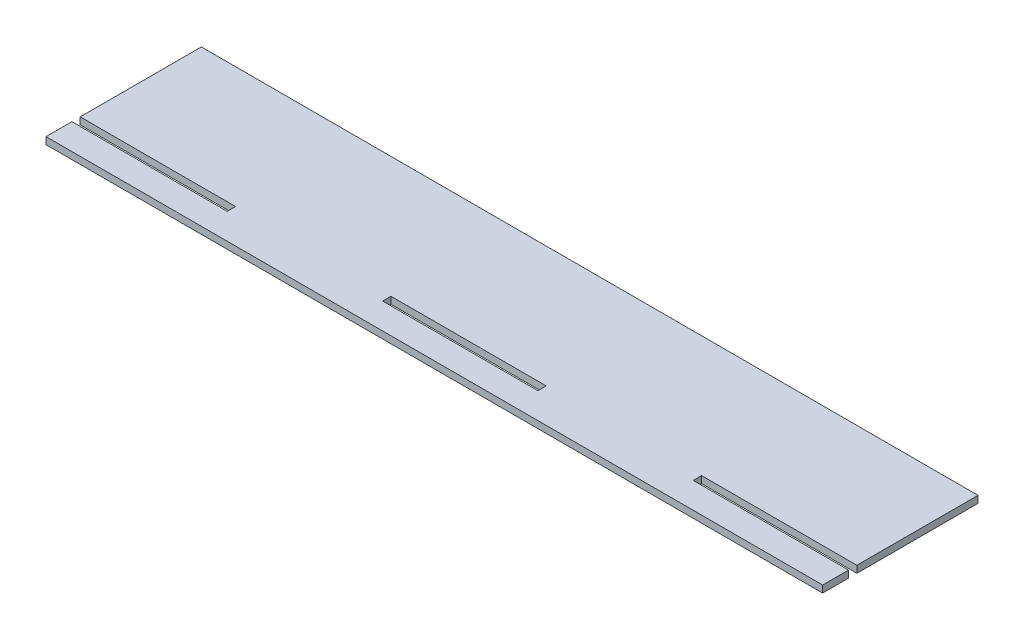
ISO-10303-21;
HEADER;
FILE_DESCRIPTION(('STEP AP214'),'2;1');
FILE_NAME('part.step','',(''),(''),'','','');
FILE_SCHEMA(('AUTOMOTIVE_DESIGN { 1 0 10303 214 1 1 1 1 }'));
ENDSEC;
DATA;
#1=APPLICATION_CONTEXT('core data for automotive mechanical design processes');
#2=APPLICATION_PROTOCOL_DEFINITION('international standard','automotive_design',2000,#1);
#3=PRODUCT_CONTEXT('',#1,'mechanical');
#4=PRODUCT('Part','Part','',(#3));
#5=PRODUCT_RELATED_PRODUCT_CATEGORY('part','',(#4));
#6=PRODUCT_DEFINITION_FORMATION('','',#4);
#7=PRODUCT_DEFINITION_CONTEXT('part definition',#1,'design');
#8=PRODUCT_DEFINITION('design','',#6,#7);
#9=PRODUCT_DEFINITION_SHAPE('','',#8);
#10=(LENGTH_UNIT() NAMED_UNIT(*) SI_UNIT(.MILLI.,.METRE.));
#11=(NAMED_UNIT(*) PLANE_ANGLE_UNIT() SI_UNIT($,.RADIAN.));
#12=(NAMED_UNIT(*) SI_UNIT($,.STERADIAN.) SOLID_ANGLE_UNIT());
#13=UNCERTAINTY_MEASURE_WITH_UNIT(LENGTH_MEASURE(1.E-05),#10,'distance_accuracy_value','');
#14=(GEOMETRIC_REPRESENTATION_CONTEXT(3) GLOBAL_UNCERTAINTY_ASSIGNED_CONTEXT((#13)) GLOBAL_UNIT_ASSIGNED_CONTEXT((#10,
#11,#12)) REPRESENTATION_CONTEXT('',''));
#15=CARTESIAN_POINT('',(0.,0.,0.));
#16=DIRECTION('',(0.,0.,1.));
#17=DIRECTION('',(1.,0.,0.));
#18=AXIS2_PLACEMENT_3D('',#15,#16,#17);
#19=CARTESIAN_POINT('',(0.,2.7,0.));
#20=DIRECTION('',(0.,1.,0.));
#21=DIRECTION('',(0.,0.,1.));
#22=AXIS2_PLACEMENT_3D('',#19,#20,#21);
#23=PLANE('',#22);
#24=DIRECTION('',(0.,0.,-1.));
#25=VECTOR('',#24,1.);
#26=CARTESIAN_POINT('',(150.,2.7,20.));
#27=LINE('',#26,#25);
#28=CARTESIAN_POINT('',(150.,2.7,30.));
#29=VERTEX_POINT('',#28);
#30=CARTESIAN_POINT('',(150.,2.7,20.));
#31=VERTEX_POINT('',#30);
#32=EDGE_CURVE('E182',#29,#31,#27,.T.);
#33=ORIENTED_EDGE('',*,*,#32,.T.);
#34=DIRECTION('',(-1.,0.,0.));
#35=VECTOR('',#34,1.);
#36=CARTESIAN_POINT('',(90.,2.7,20.));
#37=LINE('',#36,#35);
#38=CARTESIAN_POINT('',(90.,2.7,20.));
#39=VERTEX_POINT('',#38);
#40=EDGE_CURVE('E185',#31,#39,#37,.T.);
#41=ORIENTED_EDGE('',*,*,#40,.T.);
#42=DIRECTION('',(0.,0.,-1.));
#43=VECTOR('',#42,1.);
#44=CARTESIAN_POINT('',(90.,2.7,16.782));
#45=LINE('',#44,#43);
#46=CARTESIAN_POINT('',(90.,2.7,16.782));
#47=VERTEX_POINT('',#46);
#48=EDGE_CURVE('E188',#39,#47,#45,.T.);
#49=ORIENTED_EDGE('',*,*,#48,.T.);
#50=DIRECTION('',(1.,0.,0.));
#51=VECTOR('',#50,1.);
#52=CARTESIAN_POINT('',(90.,2.7,16.782));
#53=LINE('',#52,#51);
#54=CARTESIAN_POINT('',(150.,2.7,16.782));
#55=VERTEX_POINT('',#54);
#56=EDGE_CURVE('E190',#47,#55,#53,.T.);
#57=ORIENTED_EDGE('',*,*,#56,.T.);
#58=DIRECTION('',(0.,0.,-1.));
#59=VECTOR('',#58,1.);
#60=CARTESIAN_POINT('',(150.,2.7,-30.));
#61=LINE('',#60,#59);
#62=CARTESIAN_POINT('',(150.,2.7,-30.));
#63=VERTEX_POINT('',#62);
#64=EDGE_CURVE('E192',#55,#63,#61,.T.);
#65=ORIENTED_EDGE('',*,*,#64,.T.);
#66=DIRECTION('',(-1.,0.,0.));
#67=VECTOR('',#66,1.);
#68=CARTESIAN_POINT('',(-150.,2.7,-30.));
#69=LINE('',#68,#67);
#70=CARTESIAN_POINT('',(-150.,2.7,-30.));
#71=VERTEX_POINT('',#70);
#72=EDGE_CURVE('E194',#63,#71,#69,.T.);
#73=ORIENTED_EDGE('',*,*,#72,.T.);
#74=DIRECTION('',(0.,0.,1.));
#75=VECTOR('',#74,1.);
#76=CARTESIAN_POINT('',(-150.,2.7,-30.));
#77=LINE('',#76,#75);
#78=CARTESIAN_POINT('',(-150.,2.7,16.782));
#79=VERTEX_POINT('',#78);
#80=EDGE_CURVE('E196',#71,#79,#77,.T.);
#81=ORIENTED_EDGE('',*,*,#80,.T.);
#82=DIRECTION('',(1.,0.,0.));
#83=VECTOR('',#82,1.);
#84=CARTESIAN_POINT('',(-150.,2.7,16.782));
#85=LINE('',#84,#83);
#86=CARTESIAN_POINT('',(-90.,2.7,16.782));
#87=VERTEX_POINT('',#86);
#88=EDGE_CURVE('E198',#79,#87,#85,.T.);
#89=ORIENTED_EDGE('',*,*,#88,.T.);
#90=DIRECTION('',(0.,0.,1.));
#91=VECTOR('',#90,1.);
#92=CARTESIAN_POINT('',(-90.,2.7,16.782));
#93=LINE('',#92,#91);
#94=CARTESIAN_POINT('',(-90.,2.7,20.));
#95=VERTEX_POINT('',#94);
#96=EDGE_CURVE('E200',#87,#95,#93,.T.);
#97=ORIENTED_EDGE('',*,*,#96,.T.);
#98=DIRECTION('',(-1.,0.,0.));
#99=VECTOR('',#98,1.);
#100=CARTESIAN_POINT('',(-150.,2.7,20.));
#101=LINE('',#100,#99);
#102=CARTESIAN_POINT('',(-150.,2.7,20.));
#103=VERTEX_POINT('',#102);
#104=EDGE_CURVE('E202',#95,#103,#101,.T.);
#105=ORIENTED_EDGE('',*,*,#104,.T.);
#106=DIRECTION('',(0.,0.,1.));
#107=VECTOR('',#106,1.);
#108=CARTESIAN_POINT('',(-150.,2.7,20.));
#109=LINE('',#108,#107);
#110=CARTESIAN_POINT('',(-150.,2.7,30.));
#111=VERTEX_POINT('',#110);
#112=EDGE_CURVE('E204',#103,#111,#109,.T.);
#113=ORIENTED_EDGE('',*,*,#112,.T.);
#114=DIRECTION('',(1.,0.,0.));
#115=VECTOR('',#114,1.);
#116=CARTESIAN_POINT('',(-150.,2.7,30.));
#117=LINE('',#116,#115);
#118=EDGE_CURVE('E206',#111,#29,#117,.T.);
#119=ORIENTED_EDGE('',*,*,#118,.T.);
#120=EDGE_LOOP('',(#33,#41,#49,#57,#65,#73,#81,#89,#97,#105,#113,#119));
#121=FACE_BOUND('',#120,.T.);
#122=DIRECTION('',(0.,0.,-1.));
#123=VECTOR('',#122,1.);
#124=CARTESIAN_POINT('',(30.,2.7,16.782));
#125=LINE('',#124,#123);
#126=CARTESIAN_POINT('',(30.,2.7,20.));
#127=VERTEX_POINT('',#126);
#128=CARTESIAN_POINT('',(30.,2.7,16.782));
#129=VERTEX_POINT('',#128);
#130=EDGE_CURVE('E154',#127,#129,#125,.T.);
#131=ORIENTED_EDGE('',*,*,#130,.F.);
#132=DIRECTION('',(1.,0.,0.));
#133=VECTOR('',#132,1.);
#134=CARTESIAN_POINT('',(-30.,2.7,20.));
#135=LINE('',#134,#133);
#136=CARTESIAN_POINT('',(-30.,2.7,20.));
#137=VERTEX_POINT('',#136);
#138=EDGE_CURVE('E146',#137,#127,#135,.T.);
#139=ORIENTED_EDGE('',*,*,#138,.F.);
#140=DIRECTION('',(0.,0.,1.));
#141=VECTOR('',#140,1.);
#142=CARTESIAN_POINT('',(-30.,2.7,16.782));
#143=LINE('',#142,#141);
#144=CARTESIAN_POINT('',(-30.,2.7,16.782));
#145=VERTEX_POINT('',#144);
#146=EDGE_CURVE('E168',#145,#137,#143,.T.);
#147=ORIENTED_EDGE('',*,*,#146,.F.);
#148=DIRECTION('',(-1.,0.,0.));
#149=VECTOR('',#148,1.);
#150=CARTESIAN_POINT('',(-30.,2.7,16.782));
#151=LINE('',#150,#149);
#152=EDGE_CURVE('E166',#129,#145,#151,.T.);
#153=ORIENTED_EDGE('',*,*,#152,.F.);
#154=EDGE_LOOP('',(#131,#139,#147,#153));
#155=FACE_BOUND('',#154,.T.);
#156=ADVANCED_FACE('F33',(#121,#155),#23,.T.);
#157=CARTESIAN_POINT('',(0.,0.,0.));
#158=DIRECTION('',(0.,1.,0.));
#159=DIRECTION('',(0.,0.,1.));
#160=AXIS2_PLACEMENT_3D('',#157,#158,#159);
#161=PLANE('',#160);
#162=DIRECTION('',(0.,0.,-1.));
#163=VECTOR('',#162,1.);
#164=CARTESIAN_POINT('',(150.,0.,20.));
#165=LINE('',#164,#163);
#166=CARTESIAN_POINT('',(150.,0.,30.));
#167=VERTEX_POINT('',#166);
#168=CARTESIAN_POINT('',(150.,0.,20.));
#169=VERTEX_POINT('',#168);
#170=EDGE_CURVE('E162',#167,#169,#165,.T.);
#171=ORIENTED_EDGE('',*,*,#170,.F.);
#172=DIRECTION('',(1.,0.,0.));
#173=VECTOR('',#172,1.);
#174=CARTESIAN_POINT('',(-150.,0.,30.));
#175=LINE('',#174,#173);
#176=CARTESIAN_POINT('',(-150.,0.,30.));
#177=VERTEX_POINT('',#176);
#178=EDGE_CURVE('E186',#177,#167,#175,.T.);
#179=ORIENTED_EDGE('',*,*,#178,.F.);
#180=DIRECTION('',(0.,0.,1.));
#181=VECTOR('',#180,1.);
#182=CARTESIAN_POINT('',(-150.,0.,20.));
#183=LINE('',#182,#181);
#184=CARTESIAN_POINT('',(-150.,0.,20.));
#185=VERTEX_POINT('',#184);
#186=EDGE_CURVE('E229',#185,#177,#183,.T.);
#187=ORIENTED_EDGE('',*,*,#186,.F.);
#188=DIRECTION('',(-1.,0.,0.));
#189=VECTOR('',#188,1.);
#190=CARTESIAN_POINT('',(-150.,0.,20.));
#191=LINE('',#190,#189);
#192=CARTESIAN_POINT('',(-90.,0.,20.));
#193=VERTEX_POINT('',#192);
#194=EDGE_CURVE('E227',#193,#185,#191,.T.);
#195=ORIENTED_EDGE('',*,*,#194,.F.);
#196=DIRECTION('',(0.,0.,1.));
#197=VECTOR('',#196,1.);
#198=CARTESIAN_POINT('',(-90.,0.,16.782));
#199=LINE('',#198,#197);
#200=CARTESIAN_POINT('',(-90.,0.,16.782));
#201=VERTEX_POINT('',#200);
#202=EDGE_CURVE('E225',#201,#193,#199,.T.);
#203=ORIENTED_EDGE('',*,*,#202,.F.);
#204=DIRECTION('',(1.,0.,0.));
#205=VECTOR('',#204,1.);
#206=CARTESIAN_POINT('',(-150.,0.,16.782));
#207=LINE('',#206,#205);
#208=CARTESIAN_POINT('',(-150.,0.,16.782));
#209=VERTEX_POINT('',#208);
#210=EDGE_CURVE('E223',#209,#201,#207,.T.);
#211=ORIENTED_EDGE('',*,*,#210,.F.);
#212=DIRECTION('',(0.,0.,1.));
#213=VECTOR('',#212,1.);
#214=CARTESIAN_POINT('',(-150.,0.,-30.));
#215=LINE('',#214,#213);
#216=CARTESIAN_POINT('',(-150.,0.,-30.));
#217=VERTEX_POINT('',#216);
#218=EDGE_CURVE('E221',#217,#209,#215,.T.);
#219=ORIENTED_EDGE('',*,*,#218,.F.);
#220=DIRECTION('',(-1.,0.,0.));
#221=VECTOR('',#220,1.);
#222=CARTESIAN_POINT('',(-150.,0.,-30.));
#223=LINE('',#222,#221);
#224=CARTESIAN_POINT('',(150.,0.,-30.));
#225=VERTEX_POINT('',#224);
#226=EDGE_CURVE('E219',#225,#217,#223,.T.);
#227=ORIENTED_EDGE('',*,*,#226,.F.);
#228=DIRECTION('',(0.,0.,-1.));
#229=VECTOR('',#228,1.);
#230=CARTESIAN_POINT('',(150.,0.,-30.));
#231=LINE('',#230,#229);
#232=CARTESIAN_POINT('',(150.,0.,16.782));
#233=VERTEX_POINT('',#232);
#234=EDGE_CURVE('E217',#233,#225,#231,.T.);
#235=ORIENTED_EDGE('',*,*,#234,.F.);
#236=DIRECTION('',(1.,0.,0.));
#237=VECTOR('',#236,1.);
#238=CARTESIAN_POINT('',(90.,0.,16.782));
#239=LINE('',#238,#237);
#240=CARTESIAN_POINT('',(90.,0.,16.782));
#241=VERTEX_POINT('',#240);
#242=EDGE_CURVE('E215',#241,#233,#239,.T.);
#243=ORIENTED_EDGE('',*,*,#242,.F.);
#244=DIRECTION('',(0.,0.,-1.));
#245=VECTOR('',#244,1.);
#246=CARTESIAN_POINT('',(90.,0.,16.782));
#247=LINE('',#246,#245);
#248=CARTESIAN_POINT('',(90.,0.,20.));
#249=VERTEX_POINT('',#248);
#250=EDGE_CURVE('E213',#249,#241,#247,.T.);
#251=ORIENTED_EDGE('',*,*,#250,.F.);
#252=DIRECTION('',(-1.,0.,0.));
#253=VECTOR('',#252,1.);
#254=CARTESIAN_POINT('',(90.,0.,20.));
#255=LINE('',#254,#253);
#256=EDGE_CURVE('E211',#169,#249,#255,.T.);
#257=ORIENTED_EDGE('',*,*,#256,.F.);
#258=EDGE_LOOP('',(#171,#179,#187,#195,#203,#211,#219,#227,#235,#243,#251,#257));
#259=FACE_BOUND('',#258,.T.);
#260=DIRECTION('',(1.,0.,0.));
#261=VECTOR('',#260,1.);
#262=CARTESIAN_POINT('',(-30.,0.,20.));
#263=LINE('',#262,#261);
#264=CARTESIAN_POINT('',(-30.,0.,20.));
#265=VERTEX_POINT('',#264);
#266=CARTESIAN_POINT('',(30.,0.,20.));
#267=VERTEX_POINT('',#266);
#268=EDGE_CURVE('E56',#265,#267,#263,.T.);
#269=ORIENTED_EDGE('',*,*,#268,.T.);
#270=DIRECTION('',(0.,0.,-1.));
#271=VECTOR('',#270,1.);
#272=CARTESIAN_POINT('',(30.,0.,16.782));
#273=LINE('',#272,#271);
#274=CARTESIAN_POINT('',(30.,0.,16.782));
#275=VERTEX_POINT('',#274);
#276=EDGE_CURVE('E161',#267,#275,#273,.T.);
#277=ORIENTED_EDGE('',*,*,#276,.T.);
#278=DIRECTION('',(-1.,0.,0.));
#279=VECTOR('',#278,1.);
#280=CARTESIAN_POINT('',(-30.,0.,16.782));
#281=LINE('',#280,#279);
#282=CARTESIAN_POINT('',(-30.,0.,16.782));
#283=VERTEX_POINT('',#282);
#284=EDGE_CURVE('E174',#275,#283,#281,.T.);
#285=ORIENTED_EDGE('',*,*,#284,.T.);
#286=DIRECTION('',(0.,0.,1.));
#287=VECTOR('',#286,1.);
#288=CARTESIAN_POINT('',(-30.,0.,16.782));
#289=LINE('',#288,#287);
#290=EDGE_CURVE('E155',#283,#265,#289,.T.);
#291=ORIENTED_EDGE('',*,*,#290,.T.);
#292=EDGE_LOOP('',(#269,#277,#285,#291));
#293=FACE_BOUND('',#292,.T.);
#294=ADVANCED_FACE('F271',(#259,#293),#161,.F.);
#295=CARTESIAN_POINT('',(150.,2.7,20.));
#296=DIRECTION('',(-1.,0.,0.));
#297=DIRECTION('',(0.,0.,1.));
#298=AXIS2_PLACEMENT_3D('',#295,#296,#297);
#299=PLANE('',#298);
#300=ORIENTED_EDGE('',*,*,#170,.T.);
#301=DIRECTION('',(0.,-1.,0.));
#302=VECTOR('',#301,1.);
#303=CARTESIAN_POINT('',(150.,2.7,20.));
#304=LINE('',#303,#302);
#305=EDGE_CURVE('E11',#31,#169,#304,.T.);
#306=ORIENTED_EDGE('',*,*,#305,.F.);
#307=ORIENTED_EDGE('',*,*,#32,.F.);
#308=DIRECTION('',(0.,-1.,0.));
#309=VECTOR('',#308,1.);
#310=CARTESIAN_POINT('',(150.,2.7,30.));
#311=LINE('',#310,#309);
#312=EDGE_CURVE('E208',#29,#167,#311,.T.);
#313=ORIENTED_EDGE('',*,*,#312,.T.);
#314=EDGE_LOOP('',(#300,#306,#307,#313));
#315=FACE_BOUND('',#314,.T.);
#316=ADVANCED_FACE('F35',(#315),#299,.F.);
#317=CARTESIAN_POINT('',(90.,2.7,20.));
#318=DIRECTION('',(0.,0.,1.));
#319=DIRECTION('',(1.,0.,0.));
#320=AXIS2_PLACEMENT_3D('',#317,#318,#319);
#321=PLANE('',#320);
#322=ORIENTED_EDGE('',*,*,#256,.T.);
#323=DIRECTION('',(0.,-1.,0.));
#324=VECTOR('',#323,1.);
#325=CARTESIAN_POINT('',(90.,2.7,20.));
#326=LINE('',#325,#324);
#327=EDGE_CURVE('E41',#39,#249,#326,.T.);
#328=ORIENTED_EDGE('',*,*,#327,.F.);
#329=ORIENTED_EDGE('',*,*,#40,.F.);
#330=ORIENTED_EDGE('',*,*,#305,.T.);
#331=EDGE_LOOP('',(#322,#328,#329,#330));
#332=FACE_BOUND('',#331,.T.);
#333=ADVANCED_FACE('F288',(#332),#321,.F.);
#334=CARTESIAN_POINT('',(90.,2.7,16.782));
#335=DIRECTION('',(-1.,0.,0.));
#336=DIRECTION('',(0.,0.,1.));
#337=AXIS2_PLACEMENT_3D('',#334,#335,#336);
#338=PLANE('',#337);
#339=ORIENTED_EDGE('',*,*,#250,.T.);
#340=DIRECTION('',(0.,-1.,0.));
#341=VECTOR('',#340,1.);
#342=CARTESIAN_POINT('',(90.,2.7,16.782));
#343=LINE('',#342,#341);
#344=EDGE_CURVE('E258',#47,#241,#343,.T.);
#345=ORIENTED_EDGE('',*,*,#344,.F.);
#346=ORIENTED_EDGE('',*,*,#48,.F.);
#347=ORIENTED_EDGE('',*,*,#327,.T.);
#348=EDGE_LOOP('',(#339,#345,#346,#347));
#349=FACE_BOUND('',#348,.T.);
#350=ADVANCED_FACE('F265',(#349),#338,.F.);
#351=CARTESIAN_POINT('',(90.,2.7,16.782));
#352=DIRECTION('',(0.,0.,-1.));
#353=DIRECTION('',(-1.,0.,0.));
#354=AXIS2_PLACEMENT_3D('',#351,#352,#353);
#355=PLANE('',#354);
#356=ORIENTED_EDGE('',*,*,#242,.T.);
#357=DIRECTION('',(0.,-1.,0.));
#358=VECTOR('',#357,1.);
#359=CARTESIAN_POINT('',(150.,2.7,16.782));
#360=LINE('',#359,#358);
#361=EDGE_CURVE('E255',#55,#233,#360,.T.);
#362=ORIENTED_EDGE('',*,*,#361,.F.);
#363=ORIENTED_EDGE('',*,*,#56,.F.);
#364=ORIENTED_EDGE('',*,*,#344,.T.);
#365=EDGE_LOOP('',(#356,#362,#363,#364));
#366=FACE_BOUND('',#365,.T.);
#367=ADVANCED_FACE('F277',(#366),#355,.F.);
#368=CARTESIAN_POINT('',(150.,2.7,-30.));
#369=DIRECTION('',(-1.,0.,0.));
#370=DIRECTION('',(0.,0.,1.));
#371=AXIS2_PLACEMENT_3D('',#368,#369,#370);
#372=PLANE('',#371);
#373=ORIENTED_EDGE('',*,*,#234,.T.);
#374=DIRECTION('',(0.,-1.,0.));
#375=VECTOR('',#374,1.);
#376=CARTESIAN_POINT('',(150.,2.7,-30.));
#377=LINE('',#376,#375);
#378=EDGE_CURVE('E252',#63,#225,#377,.T.);
#379=ORIENTED_EDGE('',*,*,#378,.F.);
#380=ORIENTED_EDGE('',*,*,#64,.F.);
#381=ORIENTED_EDGE('',*,*,#361,.T.);
#382=EDGE_LOOP('',(#373,#379,#380,#381));
#383=FACE_BOUND('',#382,.T.);
#384=ADVANCED_FACE('F281',(#383),#372,.F.);
#385=CARTESIAN_POINT('',(-150.,2.7,-30.));
#386=DIRECTION('',(0.,0.,1.));
#387=DIRECTION('',(1.,0.,0.));
#388=AXIS2_PLACEMENT_3D('',#385,#386,#387);
#389=PLANE('',#388);
#390=ORIENTED_EDGE('',*,*,#226,.T.);
#391=DIRECTION('',(0.,-1.,0.));
#392=VECTOR('',#391,1.);
#393=CARTESIAN_POINT('',(-150.,2.7,-30.));
#394=LINE('',#393,#392);
#395=EDGE_CURVE('E249',#71,#217,#394,.T.);
#396=ORIENTED_EDGE('',*,*,#395,.F.);
#397=ORIENTED_EDGE('',*,*,#72,.F.);
#398=ORIENTED_EDGE('',*,*,#378,.T.);
#399=EDGE_LOOP('',(#390,#396,#397,#398));
#400=FACE_BOUND('',#399,.T.);
#401=ADVANCED_FACE('F321',(#400),#389,.F.);
#402=CARTESIAN_POINT('',(-150.,2.7,-30.));
#403=DIRECTION('',(1.,0.,0.));
#404=DIRECTION('',(0.,0.,-1.));
#405=AXIS2_PLACEMENT_3D('',#402,#403,#404);
#406=PLANE('',#405);
#407=ORIENTED_EDGE('',*,*,#218,.T.);
#408=DIRECTION('',(0.,-1.,0.));
#409=VECTOR('',#408,1.);
#410=CARTESIAN_POINT('',(-150.,2.7,16.782));
#411=LINE('',#410,#409);
#412=EDGE_CURVE('E246',#79,#209,#411,.T.);
#413=ORIENTED_EDGE('',*,*,#412,.F.);
#414=ORIENTED_EDGE('',*,*,#80,.F.);
#415=ORIENTED_EDGE('',*,*,#395,.T.);
#416=EDGE_LOOP('',(#407,#413,#414,#415));
#417=FACE_BOUND('',#416,.T.);
#418=ADVANCED_FACE('F319',(#417),#406,.F.);
#419=CARTESIAN_POINT('',(-150.,2.7,16.782));
#420=DIRECTION('',(0.,0.,-1.));
#421=DIRECTION('',(-1.,0.,0.));
#422=AXIS2_PLACEMENT_3D('',#419,#420,#421);
#423=PLANE('',#422);
#424=ORIENTED_EDGE('',*,*,#210,.T.);
#425=DIRECTION('',(0.,-1.,0.));
#426=VECTOR('',#425,1.);
#427=CARTESIAN_POINT('',(-90.,2.7,16.782));
#428=LINE('',#427,#426);
#429=EDGE_CURVE('E243',#87,#201,#428,.T.);
#430=ORIENTED_EDGE('',*,*,#429,.F.);
#431=ORIENTED_EDGE('',*,*,#88,.F.);
#432=ORIENTED_EDGE('',*,*,#412,.T.);
#433=EDGE_LOOP('',(#424,#430,#431,#432));
#434=FACE_BOUND('',#433,.T.);
#435=ADVANCED_FACE('F315',(#434),#423,.F.);
#436=CARTESIAN_POINT('',(-90.,2.7,16.782));
#437=DIRECTION('',(1.,0.,0.));
#438=DIRECTION('',(0.,0.,-1.));
#439=AXIS2_PLACEMENT_3D('',#436,#437,#438);
#440=PLANE('',#439);
#441=ORIENTED_EDGE('',*,*,#202,.T.);
#442=DIRECTION('',(0.,-1.,0.));
#443=VECTOR('',#442,1.);
#444=CARTESIAN_POINT('',(-90.,2.7,20.));
#445=LINE('',#444,#443);
#446=EDGE_CURVE('E240',#95,#193,#445,.T.);
#447=ORIENTED_EDGE('',*,*,#446,.F.);
#448=ORIENTED_EDGE('',*,*,#96,.F.);
#449=ORIENTED_EDGE('',*,*,#429,.T.);
#450=EDGE_LOOP('',(#441,#447,#448,#449));
#451=FACE_BOUND('',#450,.T.);
#452=ADVANCED_FACE('F310',(#451),#440,.F.);
#453=CARTESIAN_POINT('',(-150.,2.7,20.));
#454=DIRECTION('',(0.,0.,1.));
#455=DIRECTION('',(1.,0.,0.));
#456=AXIS2_PLACEMENT_3D('',#453,#454,#455);
#457=PLANE('',#456);
#458=ORIENTED_EDGE('',*,*,#194,.T.);
#459=DIRECTION('',(0.,-1.,0.));
#460=VECTOR('',#459,1.);
#461=CARTESIAN_POINT('',(-150.,2.7,20.));
#462=LINE('',#461,#460);
#463=EDGE_CURVE('E237',#103,#185,#462,.T.);
#464=ORIENTED_EDGE('',*,*,#463,.F.);
#465=ORIENTED_EDGE('',*,*,#104,.F.);
#466=ORIENTED_EDGE('',*,*,#446,.T.);
#467=EDGE_LOOP('',(#458,#464,#465,#466));
#468=FACE_BOUND('',#467,.T.);
#469=ADVANCED_FACE('F304',(#468),#457,.F.);
#470=CARTESIAN_POINT('',(-150.,2.7,20.));
#471=DIRECTION('',(1.,0.,0.));
#472=DIRECTION('',(0.,0.,-1.));
#473=AXIS2_PLACEMENT_3D('',#470,#471,#472);
#474=PLANE('',#473);
#475=ORIENTED_EDGE('',*,*,#186,.T.);
#476=DIRECTION('',(0.,-1.,0.));
#477=VECTOR('',#476,1.);
#478=CARTESIAN_POINT('',(-150.,2.7,30.));
#479=LINE('',#478,#477);
#480=EDGE_CURVE('E234',#111,#177,#479,.T.);
#481=ORIENTED_EDGE('',*,*,#480,.F.);
#482=ORIENTED_EDGE('',*,*,#112,.F.);
#483=ORIENTED_EDGE('',*,*,#463,.T.);
#484=EDGE_LOOP('',(#475,#481,#482,#483));
#485=FACE_BOUND('',#484,.T.);
#486=ADVANCED_FACE('F300',(#485),#474,.F.);
#487=CARTESIAN_POINT('',(-150.,2.7,30.));
#488=DIRECTION('',(0.,0.,-1.));
#489=DIRECTION('',(-1.,0.,0.));
#490=AXIS2_PLACEMENT_3D('',#487,#488,#489);
#491=PLANE('',#490);
#492=ORIENTED_EDGE('',*,*,#178,.T.);
#493=ORIENTED_EDGE('',*,*,#312,.F.);
#494=ORIENTED_EDGE('',*,*,#118,.F.);
#495=ORIENTED_EDGE('',*,*,#480,.T.);
#496=EDGE_LOOP('',(#492,#493,#494,#495));
#497=FACE_BOUND('',#496,.T.);
#498=ADVANCED_FACE('F295',(#497),#491,.F.);
#499=CARTESIAN_POINT('',(-30.,2.7,20.));
#500=DIRECTION('',(0.,0.,-1.));
#501=DIRECTION('',(-1.,0.,0.));
#502=AXIS2_PLACEMENT_3D('',#499,#500,#501);
#503=PLANE('',#502);
#504=ORIENTED_EDGE('',*,*,#268,.F.);
#505=DIRECTION('',(0.,-1.,0.));
#506=VECTOR('',#505,1.);
#507=CARTESIAN_POINT('',(-30.,2.7,20.));
#508=LINE('',#507,#506);
#509=EDGE_CURVE('E150',#137,#265,#508,.T.);
#510=ORIENTED_EDGE('',*,*,#509,.F.);
#511=ORIENTED_EDGE('',*,*,#138,.T.);
#512=DIRECTION('',(0.,-1.,0.));
#513=VECTOR('',#512,1.);
#514=CARTESIAN_POINT('',(30.,2.7,20.));
#515=LINE('',#514,#513);
#516=EDGE_CURVE('E149',#127,#267,#515,.T.);
#517=ORIENTED_EDGE('',*,*,#516,.T.);
#518=EDGE_LOOP('',(#504,#510,#511,#517));
#519=FACE_BOUND('',#518,.T.);
#520=ADVANCED_FACE('F148',(#519),#503,.T.);
#521=CARTESIAN_POINT('',(30.,2.7,16.782));
#522=DIRECTION('',(-1.,0.,0.));
#523=DIRECTION('',(0.,0.,1.));
#524=AXIS2_PLACEMENT_3D('',#521,#522,#523);
#525=PLANE('',#524);
#526=ORIENTED_EDGE('',*,*,#276,.F.);
#527=ORIENTED_EDGE('',*,*,#516,.F.);
#528=ORIENTED_EDGE('',*,*,#130,.T.);
#529=DIRECTION('',(0.,-1.,0.));
#530=VECTOR('',#529,1.);
#531=CARTESIAN_POINT('',(30.,2.7,16.782));
#532=LINE('',#531,#530);
#533=EDGE_CURVE('E163',#129,#275,#532,.T.);
#534=ORIENTED_EDGE('',*,*,#533,.T.);
#535=EDGE_LOOP('',(#526,#527,#528,#534));
#536=FACE_BOUND('',#535,.T.);
#537=ADVANCED_FACE('F158',(#536),#525,.T.);
#538=CARTESIAN_POINT('',(-30.,2.7,16.782));
#539=DIRECTION('',(0.,0.,1.));
#540=DIRECTION('',(1.,0.,0.));
#541=AXIS2_PLACEMENT_3D('',#538,#539,#540);
#542=PLANE('',#541);
#543=ORIENTED_EDGE('',*,*,#284,.F.);
#544=ORIENTED_EDGE('',*,*,#533,.F.);
#545=ORIENTED_EDGE('',*,*,#152,.T.);
#546=DIRECTION('',(0.,-1.,0.));
#547=VECTOR('',#546,1.);
#548=CARTESIAN_POINT('',(-30.,2.7,16.782));
#549=LINE('',#548,#547);
#550=EDGE_CURVE('E48',#145,#283,#549,.T.);
#551=ORIENTED_EDGE('',*,*,#550,.T.);
#552=EDGE_LOOP('',(#543,#544,#545,#551));
#553=FACE_BOUND('',#552,.T.);
#554=ADVANCED_FACE('F379',(#553),#542,.T.);
#555=CARTESIAN_POINT('',(-30.,2.7,16.782));
#556=DIRECTION('',(1.,0.,0.));
#557=DIRECTION('',(0.,0.,-1.));
#558=AXIS2_PLACEMENT_3D('',#555,#556,#557);
#559=PLANE('',#558);
#560=ORIENTED_EDGE('',*,*,#290,.F.);
#561=ORIENTED_EDGE('',*,*,#550,.F.);
#562=ORIENTED_EDGE('',*,*,#146,.T.);
#563=ORIENTED_EDGE('',*,*,#509,.T.);
#564=EDGE_LOOP('',(#560,#561,#562,#563));
#565=FACE_BOUND('',#564,.T.);
#566=ADVANCED_FACE('F385',(#565),#559,.T.);
#567=CLOSED_SHELL('',(#156,#294,#316,#333,#350,#367,#384,#401,#418,#435,#452,#469,#486,#498,
#520,#537,#554,#566));
#568=MANIFOLD_SOLID_BREP('B2',#567);
#569=ADVANCED_BREP_SHAPE_REPRESENTATION('',(#18,#568),#14);
#570=SHAPE_DEFINITION_REPRESENTATION(#9,#569);
ENDSEC;
END-ISO-10303-21;
